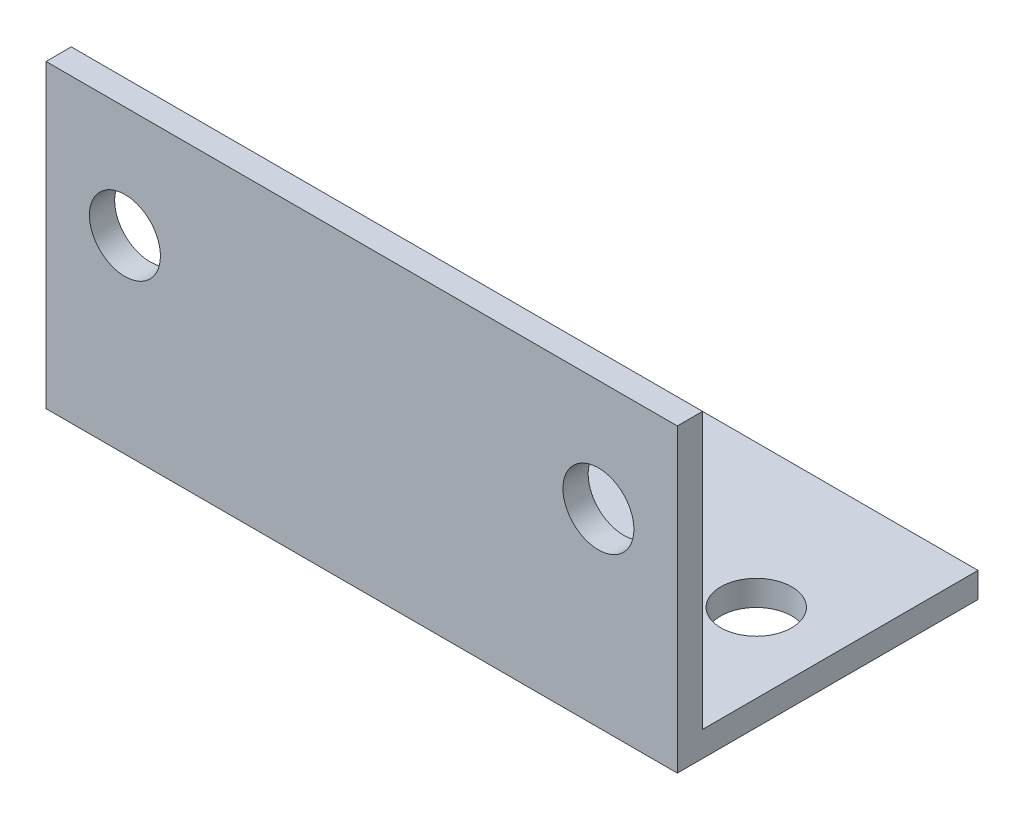
ISO-10303-21;
HEADER;
FILE_DESCRIPTION(('STEP AP214'),'2;1');
FILE_NAME('part.step','',(''),(''),'','','');
FILE_SCHEMA(('AUTOMOTIVE_DESIGN { 1 0 10303 214 1 1 1 1 }'));
ENDSEC;
DATA;
#1=APPLICATION_CONTEXT('core data for automotive mechanical design processes');
#2=APPLICATION_PROTOCOL_DEFINITION('international standard','automotive_design',2000,#1);
#3=PRODUCT_CONTEXT('',#1,'mechanical');
#4=PRODUCT('Part','Part','',(#3));
#5=PRODUCT_RELATED_PRODUCT_CATEGORY('part','',(#4));
#6=PRODUCT_DEFINITION_FORMATION('','',#4);
#7=PRODUCT_DEFINITION_CONTEXT('part definition',#1,'design');
#8=PRODUCT_DEFINITION('design','',#6,#7);
#9=PRODUCT_DEFINITION_SHAPE('','',#8);
#10=(LENGTH_UNIT() NAMED_UNIT(*) SI_UNIT(.MILLI.,.METRE.));
#11=(NAMED_UNIT(*) PLANE_ANGLE_UNIT() SI_UNIT($,.RADIAN.));
#12=(NAMED_UNIT(*) SI_UNIT($,.STERADIAN.) SOLID_ANGLE_UNIT());
#13=UNCERTAINTY_MEASURE_WITH_UNIT(LENGTH_MEASURE(1.E-05),#10,'distance_accuracy_value','');
#14=(GEOMETRIC_REPRESENTATION_CONTEXT(3) GLOBAL_UNCERTAINTY_ASSIGNED_CONTEXT((#13)) GLOBAL_UNIT_ASSIGNED_CONTEXT((#10,
#11,#12)) REPRESENTATION_CONTEXT('',''));
#15=CARTESIAN_POINT('',(0.,0.,0.));
#16=DIRECTION('',(0.,0.,1.));
#17=DIRECTION('',(1.,0.,0.));
#18=AXIS2_PLACEMENT_3D('',#15,#16,#17);
#19=CARTESIAN_POINT('',(20.,0.,-19.05));
#20=DIRECTION('',(0.,1.,0.));
#21=DIRECTION('',(0.,0.,1.));
#22=AXIS2_PLACEMENT_3D('',#19,#20,#21);
#23=PLANE('',#22);
#24=CARTESIAN_POINT('',(15.,0.,-10.));
#25=DIRECTION('',(0.,-1.,0.));
#26=DIRECTION('',(0.,0.,-1.));
#27=AXIS2_PLACEMENT_3D('',#24,#25,#26);
#28=CIRCLE('',#27,2.24999999999999);
#29=CARTESIAN_POINT('',(15.,0.,-12.25));
#30=VERTEX_POINT('',#29);
#31=EDGE_CURVE('E181',#30,#30,#28,.T.);
#32=ORIENTED_EDGE('',*,*,#31,.F.);
#33=EDGE_LOOP('',(#32));
#34=FACE_BOUND('',#33,.T.);
#35=CARTESIAN_POINT('',(-15.,0.,-10.));
#36=DIRECTION('',(0.,-1.,0.));
#37=DIRECTION('',(0.,0.,-1.));
#38=AXIS2_PLACEMENT_3D('',#35,#36,#37);
#39=CIRCLE('',#38,2.24999999999999);
#40=CARTESIAN_POINT('',(-15.,0.,-12.25));
#41=VERTEX_POINT('',#40);
#42=EDGE_CURVE('E184',#41,#41,#39,.T.);
#43=ORIENTED_EDGE('',*,*,#42,.F.);
#44=EDGE_LOOP('',(#43));
#45=FACE_BOUND('',#44,.T.);
#46=DIRECTION('',(0.,0.,-1.));
#47=VECTOR('',#46,1.);
#48=CARTESIAN_POINT('',(-20.,0.,-19.05));
#49=LINE('',#48,#47);
#50=CARTESIAN_POINT('',(-20.,0.,0.));
#51=VERTEX_POINT('',#50);
#52=CARTESIAN_POINT('',(-20.,0.,-19.05));
#53=VERTEX_POINT('',#52);
#54=EDGE_CURVE('E130',#51,#53,#49,.T.);
#55=ORIENTED_EDGE('',*,*,#54,.T.);
#56=DIRECTION('',(-1.,0.,0.));
#57=VECTOR('',#56,1.);
#58=CARTESIAN_POINT('',(20.,0.,-19.05));
#59=LINE('',#58,#57);
#60=CARTESIAN_POINT('',(20.,0.,-19.05));
#61=VERTEX_POINT('',#60);
#62=EDGE_CURVE('E11',#61,#53,#59,.T.);
#63=ORIENTED_EDGE('',*,*,#62,.F.);
#64=DIRECTION('',(0.,0.,-1.));
#65=VECTOR('',#64,1.);
#66=CARTESIAN_POINT('',(20.,0.,-19.05));
#67=LINE('',#66,#65);
#68=CARTESIAN_POINT('',(20.,0.,0.));
#69=VERTEX_POINT('',#68);
#70=EDGE_CURVE('E141',#69,#61,#67,.T.);
#71=ORIENTED_EDGE('',*,*,#70,.F.);
#72=DIRECTION('',(-1.,0.,0.));
#73=VECTOR('',#72,1.);
#74=CARTESIAN_POINT('',(20.,0.,0.));
#75=LINE('',#74,#73);
#76=EDGE_CURVE('E126',#69,#51,#75,.T.);
#77=ORIENTED_EDGE('',*,*,#76,.T.);
#78=EDGE_LOOP('',(#55,#63,#71,#77));
#79=FACE_BOUND('',#78,.T.);
#80=ADVANCED_FACE('F45',(#34,#45,#79),#23,.F.);
#81=CARTESIAN_POINT('',(20.,1.6,-19.05));
#82=DIRECTION('',(0.,0.,1.));
#83=DIRECTION('',(1.,0.,0.));
#84=AXIS2_PLACEMENT_3D('',#81,#82,#83);
#85=PLANE('',#84);
#86=DIRECTION('',(0.,1.,0.));
#87=VECTOR('',#86,1.);
#88=CARTESIAN_POINT('',(-20.,1.6,-19.05));
#89=LINE('',#88,#87);
#90=CARTESIAN_POINT('',(-20.,1.6,-19.05));
#91=VERTEX_POINT('',#90);
#92=EDGE_CURVE('E133',#53,#91,#89,.T.);
#93=ORIENTED_EDGE('',*,*,#92,.T.);
#94=DIRECTION('',(-1.,0.,0.));
#95=VECTOR('',#94,1.);
#96=CARTESIAN_POINT('',(20.,1.6,-19.05));
#97=LINE('',#96,#95);
#98=CARTESIAN_POINT('',(20.,1.6,-19.05));
#99=VERTEX_POINT('',#98);
#100=EDGE_CURVE('E54',#99,#91,#97,.T.);
#101=ORIENTED_EDGE('',*,*,#100,.F.);
#102=DIRECTION('',(0.,1.,0.));
#103=VECTOR('',#102,1.);
#104=CARTESIAN_POINT('',(20.,1.6,-19.05));
#105=LINE('',#104,#103);
#106=EDGE_CURVE('E99',#61,#99,#105,.T.);
#107=ORIENTED_EDGE('',*,*,#106,.F.);
#108=ORIENTED_EDGE('',*,*,#62,.T.);
#109=EDGE_LOOP('',(#93,#101,#107,#108));
#110=FACE_BOUND('',#109,.T.);
#111=ADVANCED_FACE('F171',(#110),#85,.F.);
#112=CARTESIAN_POINT('',(20.,1.6,-1.6));
#113=DIRECTION('',(0.,-1.,0.));
#114=DIRECTION('',(0.,0.,-1.));
#115=AXIS2_PLACEMENT_3D('',#112,#113,#114);
#116=PLANE('',#115);
#117=CARTESIAN_POINT('',(15.,1.6,-10.));
#118=DIRECTION('',(0.,-1.,0.));
#119=DIRECTION('',(0.,0.,-1.));
#120=AXIS2_PLACEMENT_3D('',#117,#118,#119);
#121=CIRCLE('',#120,2.24999999999999);
#122=CARTESIAN_POINT('',(15.,1.6,-12.25));
#123=VERTEX_POINT('',#122);
#124=EDGE_CURVE('E48',#123,#123,#121,.T.);
#125=ORIENTED_EDGE('',*,*,#124,.T.);
#126=EDGE_LOOP('',(#125));
#127=FACE_BOUND('',#126,.T.);
#128=CARTESIAN_POINT('',(-15.,1.6,-10.));
#129=DIRECTION('',(0.,-1.,0.));
#130=DIRECTION('',(0.,0.,-1.));
#131=AXIS2_PLACEMENT_3D('',#128,#129,#130);
#132=CIRCLE('',#131,2.24999999999999);
#133=CARTESIAN_POINT('',(-15.,1.6,-12.25));
#134=VERTEX_POINT('',#133);
#135=EDGE_CURVE('E186',#134,#134,#132,.T.);
#136=ORIENTED_EDGE('',*,*,#135,.T.);
#137=EDGE_LOOP('',(#136));
#138=FACE_BOUND('',#137,.T.);
#139=DIRECTION('',(0.,0.,1.));
#140=VECTOR('',#139,1.);
#141=CARTESIAN_POINT('',(-20.,1.6,-1.6));
#142=LINE('',#141,#140);
#143=CARTESIAN_POINT('',(-20.,1.6,-1.6));
#144=VERTEX_POINT('',#143);
#145=EDGE_CURVE('E136',#91,#144,#142,.T.);
#146=ORIENTED_EDGE('',*,*,#145,.T.);
#147=DIRECTION('',(-1.,0.,0.));
#148=VECTOR('',#147,1.);
#149=CARTESIAN_POINT('',(20.,1.6,-1.6));
#150=LINE('',#149,#148);
#151=CARTESIAN_POINT('',(20.,1.6,-1.6));
#152=VERTEX_POINT('',#151);
#153=EDGE_CURVE('E121',#152,#144,#150,.T.);
#154=ORIENTED_EDGE('',*,*,#153,.F.);
#155=DIRECTION('',(0.,0.,1.));
#156=VECTOR('',#155,1.);
#157=CARTESIAN_POINT('',(20.,1.6,-1.6));
#158=LINE('',#157,#156);
#159=EDGE_CURVE('E112',#99,#152,#158,.T.);
#160=ORIENTED_EDGE('',*,*,#159,.F.);
#161=ORIENTED_EDGE('',*,*,#100,.T.);
#162=EDGE_LOOP('',(#146,#154,#160,#161));
#163=FACE_BOUND('',#162,.T.);
#164=ADVANCED_FACE('F148',(#127,#138,#163),#116,.F.);
#165=CARTESIAN_POINT('',(20.,19.05,-1.6));
#166=DIRECTION('',(0.,0.,1.));
#167=DIRECTION('',(0.,-1.,0.));
#168=AXIS2_PLACEMENT_3D('',#165,#166,#167);
#169=PLANE('',#168);
#170=CARTESIAN_POINT('',(-15.,12.,-1.6));
#171=DIRECTION('',(0.,0.,1.));
#172=DIRECTION('',(0.,-1.,0.));
#173=AXIS2_PLACEMENT_3D('',#170,#171,#172);
#174=CIRCLE('',#173,2.24999999999999);
#175=CARTESIAN_POINT('',(-15.,9.75000000000001,-1.6));
#176=VERTEX_POINT('',#175);
#177=EDGE_CURVE('E196',#176,#176,#174,.T.);
#178=ORIENTED_EDGE('',*,*,#177,.T.);
#179=EDGE_LOOP('',(#178));
#180=FACE_BOUND('',#179,.T.);
#181=CARTESIAN_POINT('',(15.,12.,-1.6));
#182=DIRECTION('',(0.,0.,1.));
#183=DIRECTION('',(0.,-1.,0.));
#184=AXIS2_PLACEMENT_3D('',#181,#182,#183);
#185=CIRCLE('',#184,2.24999999999999);
#186=CARTESIAN_POINT('',(15.,9.75000000000001,-1.6));
#187=VERTEX_POINT('',#186);
#188=EDGE_CURVE('E134',#187,#187,#185,.T.);
#189=ORIENTED_EDGE('',*,*,#188,.T.);
#190=EDGE_LOOP('',(#189));
#191=FACE_BOUND('',#190,.T.);
#192=DIRECTION('',(0.,1.,0.));
#193=VECTOR('',#192,1.);
#194=CARTESIAN_POINT('',(-20.,19.05,-1.6));
#195=LINE('',#194,#193);
#196=CARTESIAN_POINT('',(-20.,19.05,-1.6));
#197=VERTEX_POINT('',#196);
#198=EDGE_CURVE('E120',#144,#197,#195,.T.);
#199=ORIENTED_EDGE('',*,*,#198,.T.);
#200=DIRECTION('',(-1.,0.,0.));
#201=VECTOR('',#200,1.);
#202=CARTESIAN_POINT('',(20.,19.05,-1.6));
#203=LINE('',#202,#201);
#204=CARTESIAN_POINT('',(20.,19.05,-1.6));
#205=VERTEX_POINT('',#204);
#206=EDGE_CURVE('E117',#205,#197,#203,.T.);
#207=ORIENTED_EDGE('',*,*,#206,.F.);
#208=DIRECTION('',(0.,1.,0.));
#209=VECTOR('',#208,1.);
#210=CARTESIAN_POINT('',(20.,19.05,-1.6));
#211=LINE('',#210,#209);
#212=EDGE_CURVE('E106',#152,#205,#211,.T.);
#213=ORIENTED_EDGE('',*,*,#212,.F.);
#214=ORIENTED_EDGE('',*,*,#153,.T.);
#215=EDGE_LOOP('',(#199,#207,#213,#214));
#216=FACE_BOUND('',#215,.T.);
#217=ADVANCED_FACE('F118',(#180,#191,#216),#169,.F.);
#218=CARTESIAN_POINT('',(20.,19.05,0.));
#219=DIRECTION('',(0.,-1.,0.));
#220=DIRECTION('',(0.,0.,-1.));
#221=AXIS2_PLACEMENT_3D('',#218,#219,#220);
#222=PLANE('',#221);
#223=DIRECTION('',(0.,0.,1.));
#224=VECTOR('',#223,1.);
#225=CARTESIAN_POINT('',(-20.,19.05,0.));
#226=LINE('',#225,#224);
#227=CARTESIAN_POINT('',(-20.,19.05,0.));
#228=VERTEX_POINT('',#227);
#229=EDGE_CURVE('E85',#197,#228,#226,.T.);
#230=ORIENTED_EDGE('',*,*,#229,.T.);
#231=DIRECTION('',(-1.,0.,0.));
#232=VECTOR('',#231,1.);
#233=CARTESIAN_POINT('',(20.,19.05,0.));
#234=LINE('',#233,#232);
#235=CARTESIAN_POINT('',(20.,19.05,0.));
#236=VERTEX_POINT('',#235);
#237=EDGE_CURVE('E122',#236,#228,#234,.T.);
#238=ORIENTED_EDGE('',*,*,#237,.F.);
#239=DIRECTION('',(0.,0.,1.));
#240=VECTOR('',#239,1.);
#241=CARTESIAN_POINT('',(20.,19.05,0.));
#242=LINE('',#241,#240);
#243=EDGE_CURVE('E110',#205,#236,#242,.T.);
#244=ORIENTED_EDGE('',*,*,#243,.F.);
#245=ORIENTED_EDGE('',*,*,#206,.T.);
#246=EDGE_LOOP('',(#230,#238,#244,#245));
#247=FACE_BOUND('',#246,.T.);
#248=ADVANCED_FACE('F124',(#247),#222,.F.);
#249=CARTESIAN_POINT('',(20.,0.,0.));
#250=DIRECTION('',(0.,0.,-1.));
#251=DIRECTION('',(-1.,0.,0.));
#252=AXIS2_PLACEMENT_3D('',#249,#250,#251);
#253=PLANE('',#252);
#254=CARTESIAN_POINT('',(-15.,12.,0.));
#255=DIRECTION('',(0.,0.,1.));
#256=DIRECTION('',(1.,0.,0.));
#257=AXIS2_PLACEMENT_3D('',#254,#255,#256);
#258=CIRCLE('',#257,2.24999999999999);
#259=CARTESIAN_POINT('',(-12.75,12.,0.));
#260=VERTEX_POINT('',#259);
#261=EDGE_CURVE('E189',#260,#260,#258,.T.);
#262=ORIENTED_EDGE('',*,*,#261,.F.);
#263=EDGE_LOOP('',(#262));
#264=FACE_BOUND('',#263,.T.);
#265=CARTESIAN_POINT('',(15.,12.,0.));
#266=DIRECTION('',(0.,0.,1.));
#267=DIRECTION('',(1.,0.,0.));
#268=AXIS2_PLACEMENT_3D('',#265,#266,#267);
#269=CIRCLE('',#268,2.24999999999999);
#270=CARTESIAN_POINT('',(17.25,12.,0.));
#271=VERTEX_POINT('',#270);
#272=EDGE_CURVE('E199',#271,#271,#269,.T.);
#273=ORIENTED_EDGE('',*,*,#272,.F.);
#274=EDGE_LOOP('',(#273));
#275=FACE_BOUND('',#274,.T.);
#276=DIRECTION('',(0.,-1.,0.));
#277=VECTOR('',#276,1.);
#278=CARTESIAN_POINT('',(-20.,0.,0.));
#279=LINE('',#278,#277);
#280=EDGE_CURVE('E91',#228,#51,#279,.T.);
#281=ORIENTED_EDGE('',*,*,#280,.T.);
#282=ORIENTED_EDGE('',*,*,#76,.F.);
#283=DIRECTION('',(0.,-1.,0.));
#284=VECTOR('',#283,1.);
#285=CARTESIAN_POINT('',(20.,0.,0.));
#286=LINE('',#285,#284);
#287=EDGE_CURVE('E62',#236,#69,#286,.T.);
#288=ORIENTED_EDGE('',*,*,#287,.F.);
#289=ORIENTED_EDGE('',*,*,#237,.T.);
#290=EDGE_LOOP('',(#281,#282,#288,#289));
#291=FACE_BOUND('',#290,.T.);
#292=ADVANCED_FACE('F155',(#264,#275,#291),#253,.F.);
#293=CARTESIAN_POINT('',(20.,0.,0.));
#294=DIRECTION('',(-1.,0.,0.));
#295=DIRECTION('',(0.,0.,1.));
#296=AXIS2_PLACEMENT_3D('',#293,#294,#295);
#297=PLANE('',#296);
#298=ORIENTED_EDGE('',*,*,#70,.T.);
#299=ORIENTED_EDGE('',*,*,#106,.T.);
#300=ORIENTED_EDGE('',*,*,#159,.T.);
#301=ORIENTED_EDGE('',*,*,#212,.T.);
#302=ORIENTED_EDGE('',*,*,#243,.T.);
#303=ORIENTED_EDGE('',*,*,#287,.T.);
#304=EDGE_LOOP('',(#298,#299,#300,#301,#302,#303));
#305=FACE_BOUND('',#304,.T.);
#306=ADVANCED_FACE('F108',(#305),#297,.F.);
#307=CARTESIAN_POINT('',(-20.,0.,0.));
#308=DIRECTION('',(-1.,0.,0.));
#309=DIRECTION('',(0.,0.,1.));
#310=AXIS2_PLACEMENT_3D('',#307,#308,#309);
#311=PLANE('',#310);
#312=ORIENTED_EDGE('',*,*,#54,.F.);
#313=ORIENTED_EDGE('',*,*,#280,.F.);
#314=ORIENTED_EDGE('',*,*,#229,.F.);
#315=ORIENTED_EDGE('',*,*,#198,.F.);
#316=ORIENTED_EDGE('',*,*,#145,.F.);
#317=ORIENTED_EDGE('',*,*,#92,.F.);
#318=EDGE_LOOP('',(#312,#313,#314,#315,#316,#317));
#319=FACE_BOUND('',#318,.T.);
#320=ADVANCED_FACE('F151',(#319),#311,.T.);
#321=CARTESIAN_POINT('',(15.,12.,0.));
#322=DIRECTION('',(0.,0.,1.));
#323=DIRECTION('',(1.,0.,0.));
#324=AXIS2_PLACEMENT_3D('',#321,#322,#323);
#325=CYLINDRICAL_SURFACE('',#324,2.24999999999999);
#326=ORIENTED_EDGE('',*,*,#272,.T.);
#327=EDGE_LOOP('',(#326));
#328=FACE_BOUND('',#327,.T.);
#329=ORIENTED_EDGE('',*,*,#188,.F.);
#330=EDGE_LOOP('',(#329));
#331=FACE_BOUND('',#330,.T.);
#332=ADVANCED_FACE('F208',(#328,#331),#325,.F.);
#333=CARTESIAN_POINT('',(-15.,12.,0.));
#334=DIRECTION('',(0.,0.,1.));
#335=DIRECTION('',(1.,0.,0.));
#336=AXIS2_PLACEMENT_3D('',#333,#334,#335);
#337=CYLINDRICAL_SURFACE('',#336,2.24999999999999);
#338=ORIENTED_EDGE('',*,*,#261,.T.);
#339=EDGE_LOOP('',(#338));
#340=FACE_BOUND('',#339,.T.);
#341=ORIENTED_EDGE('',*,*,#177,.F.);
#342=EDGE_LOOP('',(#341));
#343=FACE_BOUND('',#342,.T.);
#344=ADVANCED_FACE('F209',(#340,#343),#337,.F.);
#345=CARTESIAN_POINT('',(-15.,0.,-10.));
#346=DIRECTION('',(0.,-1.,0.));
#347=DIRECTION('',(0.,0.,-1.));
#348=AXIS2_PLACEMENT_3D('',#345,#346,#347);
#349=CYLINDRICAL_SURFACE('',#348,2.24999999999999);
#350=ORIENTED_EDGE('',*,*,#42,.T.);
#351=EDGE_LOOP('',(#350));
#352=FACE_BOUND('',#351,.T.);
#353=ORIENTED_EDGE('',*,*,#135,.F.);
#354=EDGE_LOOP('',(#353));
#355=FACE_BOUND('',#354,.T.);
#356=ADVANCED_FACE('F214',(#352,#355),#349,.F.);
#357=CARTESIAN_POINT('',(15.,0.,-10.));
#358=DIRECTION('',(0.,-1.,0.));
#359=DIRECTION('',(0.,0.,-1.));
#360=AXIS2_PLACEMENT_3D('',#357,#358,#359);
#361=CYLINDRICAL_SURFACE('',#360,2.24999999999999);
#362=ORIENTED_EDGE('',*,*,#31,.T.);
#363=EDGE_LOOP('',(#362));
#364=FACE_BOUND('',#363,.T.);
#365=ORIENTED_EDGE('',*,*,#124,.F.);
#366=EDGE_LOOP('',(#365));
#367=FACE_BOUND('',#366,.T.);
#368=ADVANCED_FACE('F221',(#364,#367),#361,.F.);
#369=CLOSED_SHELL('',(#80,#111,#164,#217,#248,#292,#306,#320,#332,#344,#356,#368));
#370=MANIFOLD_SOLID_BREP('B2',#369);
#371=ADVANCED_BREP_SHAPE_REPRESENTATION('',(#18,#370),#14);
#372=SHAPE_DEFINITION_REPRESENTATION(#9,#371);
ENDSEC;
END-ISO-10303-21;
